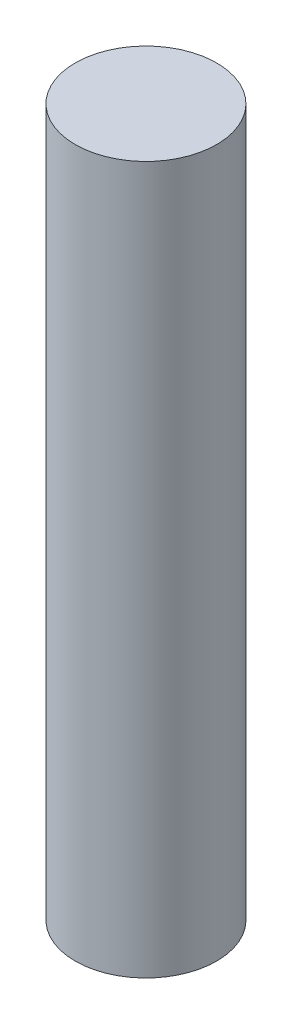
ISO-10303-21;
HEADER;
FILE_DESCRIPTION(('STEP AP214'),'2;1');
FILE_NAME('part.step','',(''),(''),'','','');
FILE_SCHEMA(('AUTOMOTIVE_DESIGN { 1 0 10303 214 1 1 1 1 }'));
ENDSEC;
DATA;
#1=APPLICATION_CONTEXT('core data for automotive mechanical design processes');
#2=APPLICATION_PROTOCOL_DEFINITION('international standard','automotive_design',2000,#1);
#3=PRODUCT_CONTEXT('',#1,'mechanical');
#4=PRODUCT('Part','Part','',(#3));
#5=PRODUCT_RELATED_PRODUCT_CATEGORY('part','',(#4));
#6=PRODUCT_DEFINITION_FORMATION('','',#4);
#7=PRODUCT_DEFINITION_CONTEXT('part definition',#1,'design');
#8=PRODUCT_DEFINITION('design','',#6,#7);
#9=PRODUCT_DEFINITION_SHAPE('','',#8);
#10=(LENGTH_UNIT() NAMED_UNIT(*) SI_UNIT(.MILLI.,.METRE.));
#11=(NAMED_UNIT(*) PLANE_ANGLE_UNIT() SI_UNIT($,.RADIAN.));
#12=(NAMED_UNIT(*) SI_UNIT($,.STERADIAN.) SOLID_ANGLE_UNIT());
#13=UNCERTAINTY_MEASURE_WITH_UNIT(LENGTH_MEASURE(1.E-05),#10,'distance_accuracy_value','');
#14=(GEOMETRIC_REPRESENTATION_CONTEXT(3) GLOBAL_UNCERTAINTY_ASSIGNED_CONTEXT((#13)) GLOBAL_UNIT_ASSIGNED_CONTEXT((#10,
#11,#12)) REPRESENTATION_CONTEXT('',''));
#15=CARTESIAN_POINT('',(0.,0.,0.));
#16=DIRECTION('',(0.,0.,1.));
#17=DIRECTION('',(1.,0.,0.));
#18=AXIS2_PLACEMENT_3D('',#15,#16,#17);
#19=CARTESIAN_POINT('',(0.,50.8,0.));
#20=DIRECTION('',(0.,-1.,0.));
#21=DIRECTION('',(0.,0.,-1.));
#22=AXIS2_PLACEMENT_3D('',#19,#20,#21);
#23=CYLINDRICAL_SURFACE('',#22,5.08);
#24=CARTESIAN_POINT('',(0.,50.8,0.));
#25=DIRECTION('',(0.,1.,0.));
#26=DIRECTION('',(0.,0.,1.));
#27=AXIS2_PLACEMENT_3D('',#24,#25,#26);
#28=CIRCLE('',#27,5.08);
#29=CARTESIAN_POINT('',(0.,50.8,5.08));
#30=VERTEX_POINT('',#29);
#31=EDGE_CURVE('E10',#30,#30,#28,.T.);
#32=ORIENTED_EDGE('',*,*,#31,.F.);
#33=EDGE_LOOP('',(#32));
#34=FACE_BOUND('',#33,.T.);
#35=CARTESIAN_POINT('',(0.,0.,0.));
#36=DIRECTION('',(0.,1.,0.));
#37=DIRECTION('',(0.,0.,1.));
#38=AXIS2_PLACEMENT_3D('',#35,#36,#37);
#39=CIRCLE('',#38,5.08);
#40=CARTESIAN_POINT('',(0.,0.,5.08));
#41=VERTEX_POINT('',#40);
#42=EDGE_CURVE('E40',#41,#41,#39,.T.);
#43=ORIENTED_EDGE('',*,*,#42,.T.);
#44=EDGE_LOOP('',(#43));
#45=FACE_BOUND('',#44,.T.);
#46=ADVANCED_FACE('F37',(#34,#45),#23,.T.);
#47=CARTESIAN_POINT('',(0.,50.8,0.));
#48=DIRECTION('',(0.,1.,0.));
#49=DIRECTION('',(0.,0.,1.));
#50=AXIS2_PLACEMENT_3D('',#47,#48,#49);
#51=PLANE('',#50);
#52=ORIENTED_EDGE('',*,*,#31,.T.);
#53=EDGE_LOOP('',(#52));
#54=FACE_BOUND('',#53,.T.);
#55=ADVANCED_FACE('F54',(#54),#51,.T.);
#56=CARTESIAN_POINT('',(0.,0.,0.));
#57=DIRECTION('',(0.,1.,0.));
#58=DIRECTION('',(0.,0.,1.));
#59=AXIS2_PLACEMENT_3D('',#56,#57,#58);
#60=PLANE('',#59);
#61=ORIENTED_EDGE('',*,*,#42,.F.);
#62=EDGE_LOOP('',(#61));
#63=FACE_BOUND('',#62,.T.);
#64=ADVANCED_FACE('F52',(#63),#60,.F.);
#65=CLOSED_SHELL('',(#46,#55,#64));
#66=MANIFOLD_SOLID_BREP('B2',#65);
#67=ADVANCED_BREP_SHAPE_REPRESENTATION('',(#18,#66),#14);
#68=SHAPE_DEFINITION_REPRESENTATION(#9,#67);
ENDSEC;
END-ISO-10303-21;
